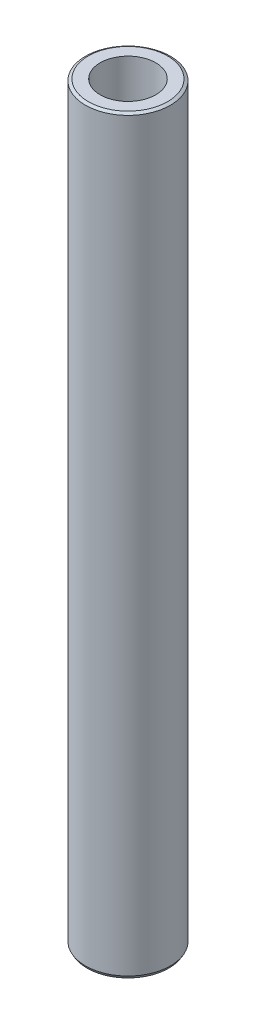
ISO-10303-21;
HEADER;
FILE_DESCRIPTION(('STEP AP214'),'2;1');
FILE_NAME('part.step','',(''),(''),'','','');
FILE_SCHEMA(('AUTOMOTIVE_DESIGN { 1 0 10303 214 1 1 1 1 }'));
ENDSEC;
DATA;
#1=APPLICATION_CONTEXT('core data for automotive mechanical design processes');
#2=APPLICATION_PROTOCOL_DEFINITION('international standard','automotive_design',2000,#1);
#3=PRODUCT_CONTEXT('',#1,'mechanical');
#4=PRODUCT('Part','Part','',(#3));
#5=PRODUCT_RELATED_PRODUCT_CATEGORY('part','',(#4));
#6=PRODUCT_DEFINITION_FORMATION('','',#4);
#7=PRODUCT_DEFINITION_CONTEXT('part definition',#1,'design');
#8=PRODUCT_DEFINITION('design','',#6,#7);
#9=PRODUCT_DEFINITION_SHAPE('','',#8);
#10=(LENGTH_UNIT() NAMED_UNIT(*) SI_UNIT(.MILLI.,.METRE.));
#11=(NAMED_UNIT(*) PLANE_ANGLE_UNIT() SI_UNIT($,.RADIAN.));
#12=(NAMED_UNIT(*) SI_UNIT($,.STERADIAN.) SOLID_ANGLE_UNIT());
#13=UNCERTAINTY_MEASURE_WITH_UNIT(LENGTH_MEASURE(1.E-05),#10,'distance_accuracy_value','');
#14=(GEOMETRIC_REPRESENTATION_CONTEXT(3) GLOBAL_UNCERTAINTY_ASSIGNED_CONTEXT((#13)) GLOBAL_UNIT_ASSIGNED_CONTEXT((#10,
#11,#12)) REPRESENTATION_CONTEXT('',''));
#15=CARTESIAN_POINT('',(0.,0.,0.));
#16=DIRECTION('',(0.,0.,1.));
#17=DIRECTION('',(1.,0.,0.));
#18=AXIS2_PLACEMENT_3D('',#15,#16,#17);
#19=CARTESIAN_POINT('',(0.,264.663394843008,0.));
#20=DIRECTION('',(0.,-1.,0.));
#21=DIRECTION('',(0.,0.,-1.));
#22=AXIS2_PLACEMENT_3D('',#19,#20,#21);
#23=CYLINDRICAL_SURFACE('',#22,15.);
#24=CARTESIAN_POINT('',(0.,264.081330924339,0.));
#25=DIRECTION('',(0.,1.,0.));
#26=DIRECTION('',(0.,0.,1.));
#27=AXIS2_PLACEMENT_3D('',#24,#25,#26);
#28=CIRCLE('',#27,15.);
#29=CARTESIAN_POINT('',(0.,264.081330924339,15.));
#30=VERTEX_POINT('',#29);
#31=EDGE_CURVE('E50',#30,#30,#28,.F.);
#32=ORIENTED_EDGE('',*,*,#31,.T.);
#33=EDGE_LOOP('',(#32));
#34=FACE_BOUND('',#33,.T.);
#35=CARTESIAN_POINT('',(0.,1.00816428038797,0.));
#36=DIRECTION('',(0.,1.,0.));
#37=DIRECTION('',(0.,0.,1.));
#38=AXIS2_PLACEMENT_3D('',#35,#36,#37);
#39=CIRCLE('',#38,15.);
#40=CARTESIAN_POINT('',(0.,1.00816428038797,15.));
#41=VERTEX_POINT('',#40);
#42=EDGE_CURVE('E51',#41,#41,#39,.T.);
#43=ORIENTED_EDGE('',*,*,#42,.T.);
#44=EDGE_LOOP('',(#43));
#45=FACE_BOUND('',#44,.T.);
#46=ADVANCED_FACE('F39',(#34,#45),#23,.T.);
#47=CARTESIAN_POINT('',(0.,264.663394843008,0.));
#48=DIRECTION('',(0.,1.,0.));
#49=DIRECTION('',(0.,0.,1.));
#50=AXIS2_PLACEMENT_3D('',#47,#48,#49);
#51=PLANE('',#50);
#52=CARTESIAN_POINT('',(0.,264.663394843008,0.));
#53=DIRECTION('',(0.,1.,0.));
#54=DIRECTION('',(0.,0.,1.));
#55=AXIS2_PLACEMENT_3D('',#52,#53,#54);
#56=CIRCLE('',#55,13.991835719612);
#57=CARTESIAN_POINT('',(0.,264.663394843008,13.991835719612));
#58=VERTEX_POINT('',#57);
#59=EDGE_CURVE('E54',#58,#58,#56,.T.);
#60=ORIENTED_EDGE('',*,*,#59,.T.);
#61=EDGE_LOOP('',(#60));
#62=FACE_BOUND('',#61,.T.);
#63=CARTESIAN_POINT('',(0.,264.663394843008,0.));
#64=DIRECTION('',(0.,1.,0.));
#65=DIRECTION('',(0.,0.,1.));
#66=AXIS2_PLACEMENT_3D('',#63,#64,#65);
#67=CIRCLE('',#66,9.81032350422588);
#68=CARTESIAN_POINT('',(0.,264.663394843008,9.81032350422588));
#69=VERTEX_POINT('',#68);
#70=EDGE_CURVE('E58',#69,#69,#67,.T.);
#71=ORIENTED_EDGE('',*,*,#70,.F.);
#72=EDGE_LOOP('',(#71));
#73=FACE_BOUND('',#72,.T.);
#74=ADVANCED_FACE('F69',(#62,#73),#51,.T.);
#75=CARTESIAN_POINT('',(0.,0.,0.));
#76=DIRECTION('',(0.,1.,0.));
#77=DIRECTION('',(0.,0.,1.));
#78=AXIS2_PLACEMENT_3D('',#75,#76,#77);
#79=PLANE('',#78);
#80=CARTESIAN_POINT('',(0.,0.,0.));
#81=DIRECTION('',(0.,1.,0.));
#82=DIRECTION('',(0.,0.,1.));
#83=AXIS2_PLACEMENT_3D('',#80,#81,#82);
#84=CIRCLE('',#83,14.4179360813306);
#85=CARTESIAN_POINT('',(0.,0.,14.4179360813306));
#86=VERTEX_POINT('',#85);
#87=EDGE_CURVE('E10',#86,#86,#84,.F.);
#88=ORIENTED_EDGE('',*,*,#87,.T.);
#89=EDGE_LOOP('',(#88));
#90=FACE_BOUND('',#89,.T.);
#91=CARTESIAN_POINT('',(0.,0.,0.));
#92=DIRECTION('',(0.,1.,0.));
#93=DIRECTION('',(0.,0.,1.));
#94=AXIS2_PLACEMENT_3D('',#91,#92,#93);
#95=CIRCLE('',#94,9.81032350422588);
#96=CARTESIAN_POINT('',(0.,0.,9.81032350422588));
#97=VERTEX_POINT('',#96);
#98=EDGE_CURVE('E63',#97,#97,#95,.T.);
#99=ORIENTED_EDGE('',*,*,#98,.T.);
#100=EDGE_LOOP('',(#99));
#101=FACE_BOUND('',#100,.T.);
#102=ADVANCED_FACE('F75',(#90,#101),#79,.F.);
#103=CARTESIAN_POINT('',(0.,264.663394843008,0.));
#104=DIRECTION('',(0.,-1.,0.));
#105=DIRECTION('',(0.,0.,-1.));
#106=AXIS2_PLACEMENT_3D('',#103,#104,#105);
#107=CYLINDRICAL_SURFACE('',#106,9.81032350422588);
#108=ORIENTED_EDGE('',*,*,#70,.T.);
#109=EDGE_LOOP('',(#108));
#110=FACE_BOUND('',#109,.T.);
#111=ORIENTED_EDGE('',*,*,#98,.F.);
#112=EDGE_LOOP('',(#111));
#113=FACE_BOUND('',#112,.T.);
#114=ADVANCED_FACE('F70',(#110,#113),#107,.F.);
#115=CARTESIAN_POINT('',(0.,264.663394843008,0.));
#116=DIRECTION('',(0.,-1.,0.));
#117=DIRECTION('',(0.,0.,-1.));
#118=AXIS2_PLACEMENT_3D('',#115,#116,#117);
#119=CONICAL_SURFACE('',#118,13.991835719612,1.04719755119661);
#120=ORIENTED_EDGE('',*,*,#31,.F.);
#121=EDGE_LOOP('',(#120));
#122=FACE_BOUND('',#121,.T.);
#123=ORIENTED_EDGE('',*,*,#59,.F.);
#124=EDGE_LOOP('',(#123));
#125=FACE_BOUND('',#124,.T.);
#126=ADVANCED_FACE('F81',(#122,#125),#119,.T.);
#127=CARTESIAN_POINT('',(0.,1.00816428038797,0.));
#128=DIRECTION('',(0.,1.,0.));
#129=DIRECTION('',(0.,0.,1.));
#130=AXIS2_PLACEMENT_3D('',#127,#128,#129);
#131=CONICAL_SURFACE('',#130,15.,0.523598775598297);
#132=ORIENTED_EDGE('',*,*,#87,.F.);
#133=EDGE_LOOP('',(#132));
#134=FACE_BOUND('',#133,.T.);
#135=ORIENTED_EDGE('',*,*,#42,.F.);
#136=EDGE_LOOP('',(#135));
#137=FACE_BOUND('',#136,.T.);
#138=ADVANCED_FACE('F45',(#134,#137),#131,.T.);
#139=CLOSED_SHELL('',(#46,#74,#102,#114,#126,#138));
#140=MANIFOLD_SOLID_BREP('B2',#139);
#141=ADVANCED_BREP_SHAPE_REPRESENTATION('',(#18,#140),#14);
#142=SHAPE_DEFINITION_REPRESENTATION(#9,#141);
ENDSEC;
END-ISO-10303-21;
